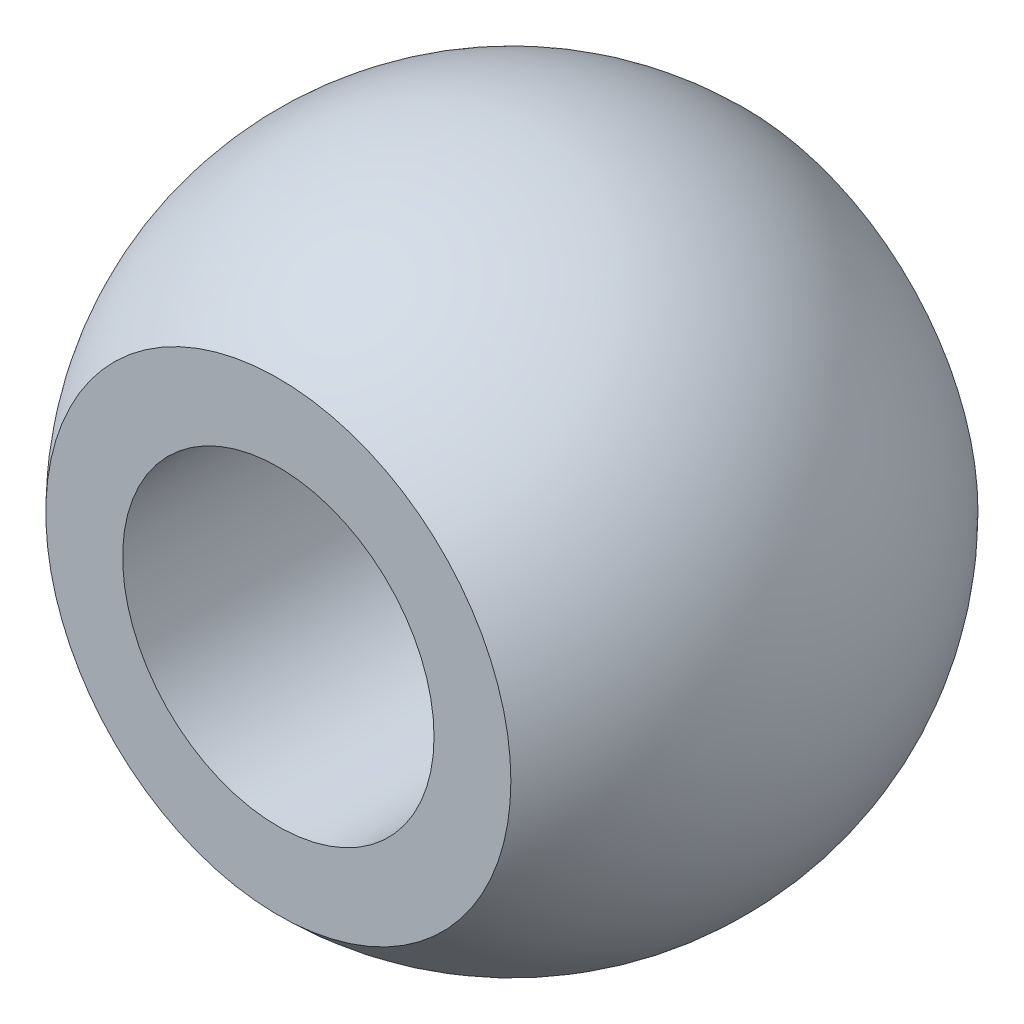
ISO-10303-21;
HEADER;
FILE_DESCRIPTION(('STEP AP214'),'2;1');
FILE_NAME('part.step','',(''),(''),'','','');
FILE_SCHEMA(('AUTOMOTIVE_DESIGN { 1 0 10303 214 1 1 1 1 }'));
ENDSEC;
DATA;
#1=APPLICATION_CONTEXT('core data for automotive mechanical design processes');
#2=APPLICATION_PROTOCOL_DEFINITION('international standard','automotive_design',2000,#1);
#3=PRODUCT_CONTEXT('',#1,'mechanical');
#4=PRODUCT('Part','Part','',(#3));
#5=PRODUCT_RELATED_PRODUCT_CATEGORY('part','',(#4));
#6=PRODUCT_DEFINITION_FORMATION('','',#4);
#7=PRODUCT_DEFINITION_CONTEXT('part definition',#1,'design');
#8=PRODUCT_DEFINITION('design','',#6,#7);
#9=PRODUCT_DEFINITION_SHAPE('','',#8);
#10=(LENGTH_UNIT() NAMED_UNIT(*) SI_UNIT(.MILLI.,.METRE.));
#11=(NAMED_UNIT(*) PLANE_ANGLE_UNIT() SI_UNIT($,.RADIAN.));
#12=(NAMED_UNIT(*) SI_UNIT($,.STERADIAN.) SOLID_ANGLE_UNIT());
#13=UNCERTAINTY_MEASURE_WITH_UNIT(LENGTH_MEASURE(1.E-05),#10,'distance_accuracy_value','');
#14=(GEOMETRIC_REPRESENTATION_CONTEXT(3) GLOBAL_UNCERTAINTY_ASSIGNED_CONTEXT((#13)) GLOBAL_UNIT_ASSIGNED_CONTEXT((#10,
#11,#12)) REPRESENTATION_CONTEXT('',''));
#15=CARTESIAN_POINT('',(0.,0.,0.));
#16=DIRECTION('',(0.,0.,1.));
#17=DIRECTION('',(1.,0.,0.));
#18=AXIS2_PLACEMENT_3D('',#15,#16,#17);
#19=CARTESIAN_POINT('',(0.,4.4802343688696,4.5));
#20=DIRECTION('',(0.,0.,-1.));
#21=DIRECTION('',(-1.,0.,0.));
#22=AXIS2_PLACEMENT_3D('',#19,#20,#21);
#23=PLANE('',#22);
#24=CARTESIAN_POINT('',(0.,0.,4.5));
#25=DIRECTION('',(0.,0.,1.));
#26=DIRECTION('',(1.,0.,0.));
#27=AXIS2_PLACEMENT_3D('',#24,#25,#26);
#28=CIRCLE('',#27,3.);
#29=CARTESIAN_POINT('',(3.,0.,4.5));
#30=VERTEX_POINT('',#29);
#31=EDGE_CURVE('E10',#30,#30,#28,.T.);
#32=ORIENTED_EDGE('',*,*,#31,.F.);
#33=EDGE_LOOP('',(#32));
#34=FACE_BOUND('',#33,.T.);
#35=CARTESIAN_POINT('',(0.,0.,4.5));
#36=DIRECTION('',(0.,0.,1.));
#37=DIRECTION('',(1.,0.,0.));
#38=AXIS2_PLACEMENT_3D('',#35,#36,#37);
#39=CIRCLE('',#38,4.4802343688696);
#40=CARTESIAN_POINT('',(4.4802343688696,0.,4.5));
#41=VERTEX_POINT('',#40);
#42=EDGE_CURVE('E56',#41,#41,#39,.T.);
#43=ORIENTED_EDGE('',*,*,#42,.T.);
#44=EDGE_LOOP('',(#43));
#45=FACE_BOUND('',#44,.T.);
#46=ADVANCED_FACE('F38',(#34,#45),#23,.F.);
#47=CARTESIAN_POINT('',(0.,0.,-4.5));
#48=DIRECTION('',(0.,0.,1.));
#49=DIRECTION('',(1.,0.,0.));
#50=AXIS2_PLACEMENT_3D('',#47,#48,#49);
#51=CYLINDRICAL_SURFACE('',#50,3.);
#52=CARTESIAN_POINT('',(0.,0.,-4.5));
#53=DIRECTION('',(0.,0.,1.));
#54=DIRECTION('',(1.,0.,0.));
#55=AXIS2_PLACEMENT_3D('',#52,#53,#54);
#56=CIRCLE('',#55,3.);
#57=CARTESIAN_POINT('',(3.,0.,-4.5));
#58=VERTEX_POINT('',#57);
#59=EDGE_CURVE('E45',#58,#58,#56,.T.);
#60=ORIENTED_EDGE('',*,*,#59,.F.);
#61=EDGE_LOOP('',(#60));
#62=FACE_BOUND('',#61,.T.);
#63=ORIENTED_EDGE('',*,*,#31,.T.);
#64=EDGE_LOOP('',(#63));
#65=FACE_BOUND('',#64,.T.);
#66=ADVANCED_FACE('F71',(#62,#65),#51,.F.);
#67=CARTESIAN_POINT('',(0.,3.,-4.5));
#68=DIRECTION('',(0.,0.,1.));
#69=DIRECTION('',(1.,0.,0.));
#70=AXIS2_PLACEMENT_3D('',#67,#68,#69);
#71=PLANE('',#70);
#72=CARTESIAN_POINT('',(0.,0.,-4.5));
#73=DIRECTION('',(0.,0.,1.));
#74=DIRECTION('',(1.,0.,0.));
#75=AXIS2_PLACEMENT_3D('',#72,#73,#74);
#76=CIRCLE('',#75,4.4802343688696);
#77=CARTESIAN_POINT('',(4.4802343688696,0.,-4.5));
#78=VERTEX_POINT('',#77);
#79=EDGE_CURVE('E50',#78,#78,#76,.T.);
#80=ORIENTED_EDGE('',*,*,#79,.F.);
#81=EDGE_LOOP('',(#80));
#82=FACE_BOUND('',#81,.T.);
#83=ORIENTED_EDGE('',*,*,#59,.T.);
#84=EDGE_LOOP('',(#83));
#85=FACE_BOUND('',#84,.T.);
#86=ADVANCED_FACE('F66',(#82,#85),#71,.F.);
#87=CARTESIAN_POINT('',(0.,-1.05818132034585E-13,0.));
#88=DIRECTION('',(0.,0.,1.));
#89=DIRECTION('',(0.,1.,0.));
#90=AXIS2_PLACEMENT_3D('',#87,#88,#89);
#91=SPHERICAL_SURFACE('',#90,6.3500000000001);
#92=ORIENTED_EDGE('',*,*,#42,.F.);
#93=EDGE_LOOP('',(#92));
#94=FACE_BOUND('',#93,.T.);
#95=ORIENTED_EDGE('',*,*,#79,.T.);
#96=EDGE_LOOP('',(#95));
#97=FACE_BOUND('',#96,.T.);
#98=ADVANCED_FACE('F63',(#94,#97),#91,.T.);
#99=CLOSED_SHELL('',(#46,#66,#86,#98));
#100=MANIFOLD_SOLID_BREP('B2',#99);
#101=ADVANCED_BREP_SHAPE_REPRESENTATION('',(#18,#100),#14);
#102=SHAPE_DEFINITION_REPRESENTATION(#9,#101);
ENDSEC;
END-ISO-10303-21;
